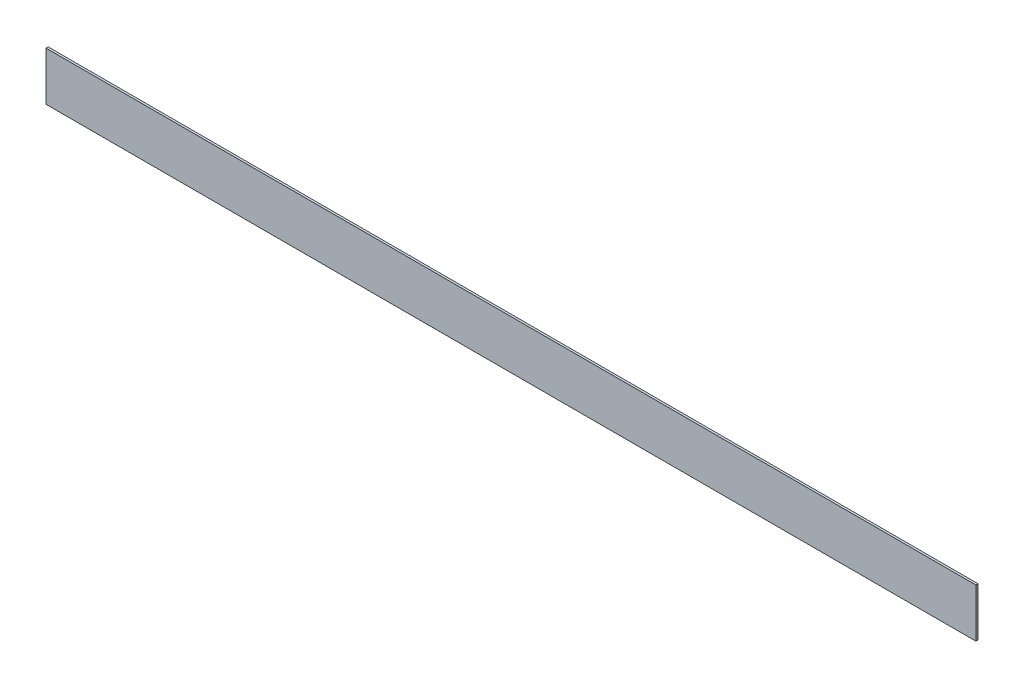
ISO-10303-21;
HEADER;
FILE_DESCRIPTION(('STEP AP214'),'2;1');
FILE_NAME('part.step','',(''),(''),'','','');
FILE_SCHEMA(('AUTOMOTIVE_DESIGN { 1 0 10303 214 1 1 1 1 }'));
ENDSEC;
DATA;
#1=APPLICATION_CONTEXT('core data for automotive mechanical design processes');
#2=APPLICATION_PROTOCOL_DEFINITION('international standard','automotive_design',2000,#1);
#3=PRODUCT_CONTEXT('',#1,'mechanical');
#4=PRODUCT('Part','Part','',(#3));
#5=PRODUCT_RELATED_PRODUCT_CATEGORY('part','',(#4));
#6=PRODUCT_DEFINITION_FORMATION('','',#4);
#7=PRODUCT_DEFINITION_CONTEXT('part definition',#1,'design');
#8=PRODUCT_DEFINITION('design','',#6,#7);
#9=PRODUCT_DEFINITION_SHAPE('','',#8);
#10=(LENGTH_UNIT() NAMED_UNIT(*) SI_UNIT(.MILLI.,.METRE.));
#11=(NAMED_UNIT(*) PLANE_ANGLE_UNIT() SI_UNIT($,.RADIAN.));
#12=(NAMED_UNIT(*) SI_UNIT($,.STERADIAN.) SOLID_ANGLE_UNIT());
#13=UNCERTAINTY_MEASURE_WITH_UNIT(LENGTH_MEASURE(1.E-05),#10,'distance_accuracy_value','');
#14=(GEOMETRIC_REPRESENTATION_CONTEXT(3) GLOBAL_UNCERTAINTY_ASSIGNED_CONTEXT((#13)) GLOBAL_UNIT_ASSIGNED_CONTEXT((#10,
#11,#12)) REPRESENTATION_CONTEXT('',''));
#15=CARTESIAN_POINT('',(0.,0.,0.));
#16=DIRECTION('',(0.,0.,1.));
#17=DIRECTION('',(1.,0.,0.));
#18=AXIS2_PLACEMENT_3D('',#15,#16,#17);
#19=CARTESIAN_POINT('',(0.,0.,-4.));
#20=DIRECTION('',(-1.,0.,0.));
#21=DIRECTION('',(0.,-1.,0.));
#22=AXIS2_PLACEMENT_3D('',#19,#20,#21);
#23=PLANE('',#22);
#24=DIRECTION('',(0.,-1.,0.));
#25=VECTOR('',#24,1.);
#26=CARTESIAN_POINT('',(0.,0.,0.));
#27=LINE('',#26,#25);
#28=CARTESIAN_POINT('',(0.,0.,0.));
#29=VERTEX_POINT('',#28);
#30=CARTESIAN_POINT('',(0.,-90.,0.));
#31=VERTEX_POINT('',#30);
#32=EDGE_CURVE('E101',#29,#31,#27,.T.);
#33=ORIENTED_EDGE('',*,*,#32,.F.);
#34=DIRECTION('',(0.,0.,1.));
#35=VECTOR('',#34,1.);
#36=CARTESIAN_POINT('',(0.,0.,-4.));
#37=LINE('',#36,#35);
#38=CARTESIAN_POINT('',(0.,0.,-4.));
#39=VERTEX_POINT('',#38);
#40=EDGE_CURVE('E11',#39,#29,#37,.T.);
#41=ORIENTED_EDGE('',*,*,#40,.F.);
#42=DIRECTION('',(0.,-1.,0.));
#43=VECTOR('',#42,1.);
#44=CARTESIAN_POINT('',(0.,0.,-4.));
#45=LINE('',#44,#43);
#46=CARTESIAN_POINT('',(0.,-90.,-4.));
#47=VERTEX_POINT('',#46);
#48=EDGE_CURVE('E95',#39,#47,#45,.T.);
#49=ORIENTED_EDGE('',*,*,#48,.T.);
#50=DIRECTION('',(0.,0.,1.));
#51=VECTOR('',#50,1.);
#52=CARTESIAN_POINT('',(0.,-90.,-4.));
#53=LINE('',#52,#51);
#54=EDGE_CURVE('E40',#47,#31,#53,.T.);
#55=ORIENTED_EDGE('',*,*,#54,.T.);
#56=EDGE_LOOP('',(#33,#41,#49,#55));
#57=FACE_BOUND('',#56,.T.);
#58=ADVANCED_FACE('F37',(#57),#23,.T.);
#59=CARTESIAN_POINT('',(0.,0.,-4.));
#60=DIRECTION('',(0.,1.,0.));
#61=DIRECTION('',(0.,0.,1.));
#62=AXIS2_PLACEMENT_3D('',#59,#60,#61);
#63=PLANE('',#62);
#64=DIRECTION('',(-1.,0.,0.));
#65=VECTOR('',#64,1.);
#66=CARTESIAN_POINT('',(0.,0.,0.));
#67=LINE('',#66,#65);
#68=CARTESIAN_POINT('',(1720.,0.,0.));
#69=VERTEX_POINT('',#68);
#70=EDGE_CURVE('E97',#69,#29,#67,.T.);
#71=ORIENTED_EDGE('',*,*,#70,.F.);
#72=DIRECTION('',(0.,0.,1.));
#73=VECTOR('',#72,1.);
#74=CARTESIAN_POINT('',(1720.,0.,-4.));
#75=LINE('',#74,#73);
#76=CARTESIAN_POINT('',(1720.,0.,-4.));
#77=VERTEX_POINT('',#76);
#78=EDGE_CURVE('E46',#77,#69,#75,.T.);
#79=ORIENTED_EDGE('',*,*,#78,.F.);
#80=DIRECTION('',(-1.,0.,0.));
#81=VECTOR('',#80,1.);
#82=CARTESIAN_POINT('',(0.,0.,-4.));
#83=LINE('',#82,#81);
#84=EDGE_CURVE('E92',#77,#39,#83,.T.);
#85=ORIENTED_EDGE('',*,*,#84,.T.);
#86=ORIENTED_EDGE('',*,*,#40,.T.);
#87=EDGE_LOOP('',(#71,#79,#85,#86));
#88=FACE_BOUND('',#87,.T.);
#89=ADVANCED_FACE('F111',(#88),#63,.T.);
#90=CARTESIAN_POINT('',(1720.,0.,-4.));
#91=DIRECTION('',(1.,0.,0.));
#92=DIRECTION('',(0.,1.,0.));
#93=AXIS2_PLACEMENT_3D('',#90,#91,#92);
#94=PLANE('',#93);
#95=DIRECTION('',(0.,1.,0.));
#96=VECTOR('',#95,1.);
#97=CARTESIAN_POINT('',(1720.,0.,0.));
#98=LINE('',#97,#96);
#99=CARTESIAN_POINT('',(1720.,-90.,0.));
#100=VERTEX_POINT('',#99);
#101=EDGE_CURVE('E87',#100,#69,#98,.T.);
#102=ORIENTED_EDGE('',*,*,#101,.F.);
#103=DIRECTION('',(0.,0.,1.));
#104=VECTOR('',#103,1.);
#105=CARTESIAN_POINT('',(1720.,-90.,-4.));
#106=LINE('',#105,#104);
#107=CARTESIAN_POINT('',(1720.,-90.,-4.));
#108=VERTEX_POINT('',#107);
#109=EDGE_CURVE('E82',#108,#100,#106,.T.);
#110=ORIENTED_EDGE('',*,*,#109,.F.);
#111=DIRECTION('',(0.,1.,0.));
#112=VECTOR('',#111,1.);
#113=CARTESIAN_POINT('',(1720.,0.,-4.));
#114=LINE('',#113,#112);
#115=EDGE_CURVE('E85',#108,#77,#114,.T.);
#116=ORIENTED_EDGE('',*,*,#115,.T.);
#117=ORIENTED_EDGE('',*,*,#78,.T.);
#118=EDGE_LOOP('',(#102,#110,#116,#117));
#119=FACE_BOUND('',#118,.T.);
#120=ADVANCED_FACE('F84',(#119),#94,.T.);
#121=CARTESIAN_POINT('',(0.,-90.,-4.));
#122=DIRECTION('',(0.,-1.,0.));
#123=DIRECTION('',(0.,0.,-1.));
#124=AXIS2_PLACEMENT_3D('',#121,#122,#123);
#125=PLANE('',#124);
#126=DIRECTION('',(1.,0.,0.));
#127=VECTOR('',#126,1.);
#128=CARTESIAN_POINT('',(0.,-90.,0.));
#129=LINE('',#128,#127);
#130=EDGE_CURVE('E104',#31,#100,#129,.T.);
#131=ORIENTED_EDGE('',*,*,#130,.F.);
#132=ORIENTED_EDGE('',*,*,#54,.F.);
#133=DIRECTION('',(1.,0.,0.));
#134=VECTOR('',#133,1.);
#135=CARTESIAN_POINT('',(0.,-90.,-4.));
#136=LINE('',#135,#134);
#137=EDGE_CURVE('E91',#47,#108,#136,.T.);
#138=ORIENTED_EDGE('',*,*,#137,.T.);
#139=ORIENTED_EDGE('',*,*,#109,.T.);
#140=EDGE_LOOP('',(#131,#132,#138,#139));
#141=FACE_BOUND('',#140,.T.);
#142=ADVANCED_FACE('F94',(#141),#125,.T.);
#143=CARTESIAN_POINT('',(0.,0.,-4.));
#144=DIRECTION('',(0.,0.,1.));
#145=DIRECTION('',(1.,0.,0.));
#146=AXIS2_PLACEMENT_3D('',#143,#144,#145);
#147=PLANE('',#146);
#148=ORIENTED_EDGE('',*,*,#48,.F.);
#149=ORIENTED_EDGE('',*,*,#84,.F.);
#150=ORIENTED_EDGE('',*,*,#115,.F.);
#151=ORIENTED_EDGE('',*,*,#137,.F.);
#152=EDGE_LOOP('',(#148,#149,#150,#151));
#153=FACE_BOUND('',#152,.T.);
#154=ADVANCED_FACE('F90',(#153),#147,.F.);
#155=CARTESIAN_POINT('',(0.,0.,0.));
#156=DIRECTION('',(0.,0.,1.));
#157=DIRECTION('',(1.,0.,0.));
#158=AXIS2_PLACEMENT_3D('',#155,#156,#157);
#159=PLANE('',#158);
#160=ORIENTED_EDGE('',*,*,#32,.T.);
#161=ORIENTED_EDGE('',*,*,#130,.T.);
#162=ORIENTED_EDGE('',*,*,#101,.T.);
#163=ORIENTED_EDGE('',*,*,#70,.T.);
#164=EDGE_LOOP('',(#160,#161,#162,#163));
#165=FACE_BOUND('',#164,.T.);
#166=ADVANCED_FACE('F110',(#165),#159,.T.);
#167=CLOSED_SHELL('',(#58,#89,#120,#142,#154,#166));
#168=MANIFOLD_SOLID_BREP('B2',#167);
#169=ADVANCED_BREP_SHAPE_REPRESENTATION('',(#18,#168),#14);
#170=SHAPE_DEFINITION_REPRESENTATION(#9,#169);
ENDSEC;
END-ISO-10303-21;
